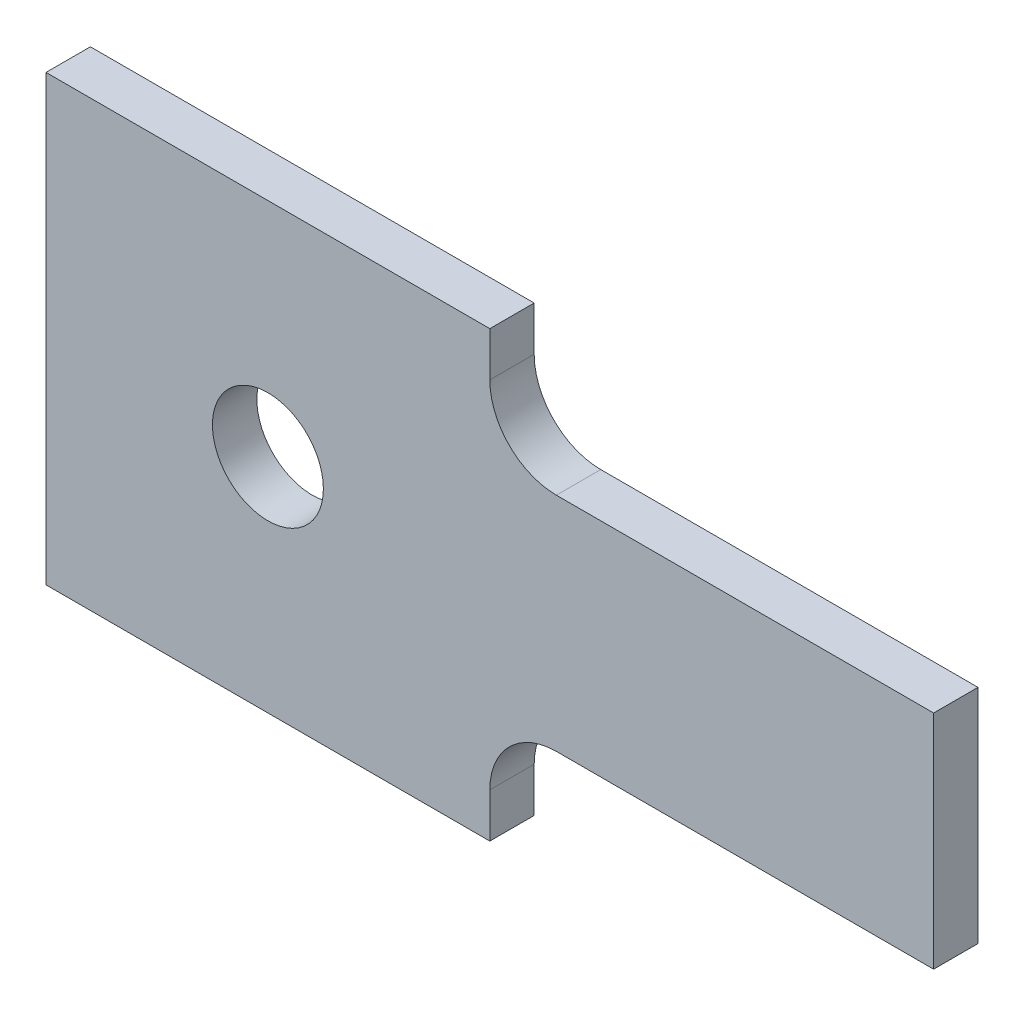
ISO-10303-21;
HEADER;
FILE_DESCRIPTION(('STEP AP214'),'2;1');
FILE_NAME('part.step','',(''),(''),'','','');
FILE_SCHEMA(('AUTOMOTIVE_DESIGN { 1 0 10303 214 1 1 1 1 }'));
ENDSEC;
DATA;
#1=APPLICATION_CONTEXT('core data for automotive mechanical design processes');
#2=APPLICATION_PROTOCOL_DEFINITION('international standard','automotive_design',2000,#1);
#3=PRODUCT_CONTEXT('',#1,'mechanical');
#4=PRODUCT('Part','Part','',(#3));
#5=PRODUCT_RELATED_PRODUCT_CATEGORY('part','',(#4));
#6=PRODUCT_DEFINITION_FORMATION('','',#4);
#7=PRODUCT_DEFINITION_CONTEXT('part definition',#1,'design');
#8=PRODUCT_DEFINITION('design','',#6,#7);
#9=PRODUCT_DEFINITION_SHAPE('','',#8);
#10=(LENGTH_UNIT() NAMED_UNIT(*) SI_UNIT(.MILLI.,.METRE.));
#11=(NAMED_UNIT(*) PLANE_ANGLE_UNIT() SI_UNIT($,.RADIAN.));
#12=(NAMED_UNIT(*) SI_UNIT($,.STERADIAN.) SOLID_ANGLE_UNIT());
#13=UNCERTAINTY_MEASURE_WITH_UNIT(LENGTH_MEASURE(1.E-05),#10,'distance_accuracy_value','');
#14=(GEOMETRIC_REPRESENTATION_CONTEXT(3) GLOBAL_UNCERTAINTY_ASSIGNED_CONTEXT((#13)) GLOBAL_UNIT_ASSIGNED_CONTEXT((#10,
#11,#12)) REPRESENTATION_CONTEXT('',''));
#15=CARTESIAN_POINT('',(0.,0.,0.));
#16=DIRECTION('',(0.,0.,1.));
#17=DIRECTION('',(1.,0.,0.));
#18=AXIS2_PLACEMENT_3D('',#15,#16,#17);
#19=CARTESIAN_POINT('',(0.,50.,10.));
#20=DIRECTION('',(1.,0.,0.));
#21=DIRECTION('',(0.,0.,-1.));
#22=AXIS2_PLACEMENT_3D('',#19,#20,#21);
#23=PLANE('',#22);
#24=DIRECTION('',(0.,-1.,0.));
#25=VECTOR('',#24,1.);
#26=CARTESIAN_POINT('',(0.,50.,5.));
#27=LINE('',#26,#25);
#28=CARTESIAN_POINT('',(0.,0.,5.));
#29=VERTEX_POINT('',#28);
#30=CARTESIAN_POINT('',(0.,-50.,5.));
#31=VERTEX_POINT('',#30);
#32=EDGE_CURVE('E11',#29,#31,#27,.T.);
#33=ORIENTED_EDGE('',*,*,#32,.F.);
#34=DIRECTION('',(0.,0.,1.));
#35=VECTOR('',#34,1.);
#36=CARTESIAN_POINT('',(0.,0.,10.));
#37=LINE('',#36,#35);
#38=CARTESIAN_POINT('',(0.,0.,0.));
#39=VERTEX_POINT('',#38);
#40=EDGE_CURVE('E163',#39,#29,#37,.T.);
#41=ORIENTED_EDGE('',*,*,#40,.F.);
#42=DIRECTION('',(0.,-1.,0.));
#43=VECTOR('',#42,1.);
#44=CARTESIAN_POINT('',(0.,50.,0.));
#45=LINE('',#44,#43);
#46=CARTESIAN_POINT('',(0.,-50.,0.));
#47=VERTEX_POINT('',#46);
#48=EDGE_CURVE('E197',#39,#47,#45,.T.);
#49=ORIENTED_EDGE('',*,*,#48,.T.);
#50=DIRECTION('',(0.,0.,-1.));
#51=VECTOR('',#50,1.);
#52=CARTESIAN_POINT('',(0.,-50.,10.));
#53=LINE('',#52,#51);
#54=EDGE_CURVE('E236',#31,#47,#53,.T.);
#55=ORIENTED_EDGE('',*,*,#54,.F.);
#56=EDGE_LOOP('',(#33,#41,#49,#55));
#57=FACE_BOUND('',#56,.T.);
#58=ADVANCED_FACE('F45',(#57),#23,.F.);
#59=DIRECTION('',(0.,-1.,0.));
#60=VECTOR('',#59,1.);
#61=CARTESIAN_POINT('',(0.,50.,5.));
#62=LINE('',#61,#60);
#63=CARTESIAN_POINT('',(0.,50.,5.));
#64=VERTEX_POINT('',#63);
#65=EDGE_CURVE('E49',#64,#29,#62,.T.);
#66=ORIENTED_EDGE('',*,*,#65,.F.);
#67=DIRECTION('',(0.,0.,-1.));
#68=VECTOR('',#67,1.);
#69=CARTESIAN_POINT('',(0.,50.,10.));
#70=LINE('',#69,#68);
#71=CARTESIAN_POINT('',(0.,50.,0.));
#72=VERTEX_POINT('',#71);
#73=EDGE_CURVE('E160',#64,#72,#70,.T.);
#74=ORIENTED_EDGE('',*,*,#73,.T.);
#75=EDGE_CURVE('E199',#72,#39,#45,.T.);
#76=ORIENTED_EDGE('',*,*,#75,.T.);
#77=ORIENTED_EDGE('',*,*,#40,.T.);
#78=EDGE_LOOP('',(#66,#74,#76,#77));
#79=FACE_BOUND('',#78,.T.);
#80=ADVANCED_FACE('F280',(#79),#23,.F.);
#81=CARTESIAN_POINT('',(0.,0.,10.));
#82=VERTEX_POINT('',#81);
#83=EDGE_CURVE('E143',#29,#82,#37,.T.);
#84=ORIENTED_EDGE('',*,*,#83,.F.);
#85=ORIENTED_EDGE('',*,*,#32,.T.);
#86=CARTESIAN_POINT('',(0.,-50.,10.));
#87=VERTEX_POINT('',#86);
#88=EDGE_CURVE('E165',#87,#31,#53,.T.);
#89=ORIENTED_EDGE('',*,*,#88,.F.);
#90=DIRECTION('',(0.,-1.,0.));
#91=VECTOR('',#90,1.);
#92=CARTESIAN_POINT('',(0.,50.,10.));
#93=LINE('',#92,#91);
#94=EDGE_CURVE('E147',#82,#87,#93,.T.);
#95=ORIENTED_EDGE('',*,*,#94,.F.);
#96=EDGE_LOOP('',(#84,#85,#89,#95));
#97=FACE_BOUND('',#96,.T.);
#98=ADVANCED_FACE('F175',(#97),#23,.F.);
#99=CARTESIAN_POINT('',(100.,50.,10.));
#100=DIRECTION('',(0.,-1.,0.));
#101=DIRECTION('',(1.,0.,0.));
#102=AXIS2_PLACEMENT_3D('',#99,#100,#101);
#103=PLANE('',#102);
#104=DIRECTION('',(-1.,0.,0.));
#105=VECTOR('',#104,1.);
#106=CARTESIAN_POINT('',(100.,50.,0.));
#107=LINE('',#106,#105);
#108=CARTESIAN_POINT('',(100.,50.,0.));
#109=VERTEX_POINT('',#108);
#110=EDGE_CURVE('E195',#109,#72,#107,.T.);
#111=ORIENTED_EDGE('',*,*,#110,.T.);
#112=ORIENTED_EDGE('',*,*,#73,.F.);
#113=CARTESIAN_POINT('',(0.,50.,10.));
#114=VERTEX_POINT('',#113);
#115=EDGE_CURVE('E142',#114,#64,#70,.T.);
#116=ORIENTED_EDGE('',*,*,#115,.F.);
#117=DIRECTION('',(-1.,0.,0.));
#118=VECTOR('',#117,1.);
#119=CARTESIAN_POINT('',(100.,50.,10.));
#120=LINE('',#119,#118);
#121=CARTESIAN_POINT('',(100.,50.,10.));
#122=VERTEX_POINT('',#121);
#123=EDGE_CURVE('E150',#122,#114,#120,.T.);
#124=ORIENTED_EDGE('',*,*,#123,.F.);
#125=DIRECTION('',(0.,0.,-1.));
#126=VECTOR('',#125,1.);
#127=CARTESIAN_POINT('',(100.,50.,10.));
#128=LINE('',#127,#126);
#129=EDGE_CURVE('E194',#122,#109,#128,.T.);
#130=ORIENTED_EDGE('',*,*,#129,.T.);
#131=EDGE_LOOP('',(#111,#112,#116,#124,#130));
#132=FACE_BOUND('',#131,.T.);
#133=ADVANCED_FACE('F47',(#132),#103,.F.);
#134=ORIENTED_EDGE('',*,*,#115,.T.);
#135=ORIENTED_EDGE('',*,*,#65,.T.);
#136=ORIENTED_EDGE('',*,*,#83,.T.);
#137=EDGE_CURVE('E138',#114,#82,#93,.T.);
#138=ORIENTED_EDGE('',*,*,#137,.F.);
#139=EDGE_LOOP('',(#134,#135,#136,#138));
#140=FACE_BOUND('',#139,.T.);
#141=ADVANCED_FACE('F140',(#140),#23,.F.);
#142=CARTESIAN_POINT('',(100.,-50.,10.));
#143=DIRECTION('',(0.,1.,0.));
#144=DIRECTION('',(-1.,0.,0.));
#145=AXIS2_PLACEMENT_3D('',#142,#143,#144);
#146=PLANE('',#145);
#147=DIRECTION('',(1.,0.,0.));
#148=VECTOR('',#147,1.);
#149=CARTESIAN_POINT('',(100.,-50.,0.));
#150=LINE('',#149,#148);
#151=CARTESIAN_POINT('',(100.,-50.,0.));
#152=VERTEX_POINT('',#151);
#153=EDGE_CURVE('E201',#47,#152,#150,.T.);
#154=ORIENTED_EDGE('',*,*,#153,.T.);
#155=DIRECTION('',(0.,0.,-1.));
#156=VECTOR('',#155,1.);
#157=CARTESIAN_POINT('',(100.,-50.,10.));
#158=LINE('',#157,#156);
#159=CARTESIAN_POINT('',(100.,-50.,10.));
#160=VERTEX_POINT('',#159);
#161=EDGE_CURVE('E234',#160,#152,#158,.T.);
#162=ORIENTED_EDGE('',*,*,#161,.F.);
#163=DIRECTION('',(1.,0.,0.));
#164=VECTOR('',#163,1.);
#165=CARTESIAN_POINT('',(100.,-50.,10.));
#166=LINE('',#165,#164);
#167=EDGE_CURVE('E146',#87,#160,#166,.T.);
#168=ORIENTED_EDGE('',*,*,#167,.F.);
#169=ORIENTED_EDGE('',*,*,#88,.T.);
#170=ORIENTED_EDGE('',*,*,#54,.T.);
#171=EDGE_LOOP('',(#154,#162,#168,#169,#170));
#172=FACE_BOUND('',#171,.T.);
#173=ADVANCED_FACE('F243',(#172),#146,.F.);
#174=CARTESIAN_POINT('',(100.,-40.0000000000001,10.));
#175=DIRECTION('',(-1.,0.,0.));
#176=DIRECTION('',(0.,0.,1.));
#177=AXIS2_PLACEMENT_3D('',#174,#175,#176);
#178=PLANE('',#177);
#179=DIRECTION('',(0.,1.,0.));
#180=VECTOR('',#179,1.);
#181=CARTESIAN_POINT('',(100.,-40.0000000000001,0.));
#182=LINE('',#181,#180);
#183=CARTESIAN_POINT('',(100.,-40.0000000000001,0.));
#184=VERTEX_POINT('',#183);
#185=EDGE_CURVE('E203',#152,#184,#182,.T.);
#186=ORIENTED_EDGE('',*,*,#185,.T.);
#187=DIRECTION('',(0.,0.,-1.));
#188=VECTOR('',#187,1.);
#189=CARTESIAN_POINT('',(100.,-40.0000000000001,10.));
#190=LINE('',#189,#188);
#191=CARTESIAN_POINT('',(100.,-40.0000000000001,10.));
#192=VERTEX_POINT('',#191);
#193=EDGE_CURVE('E232',#192,#184,#190,.T.);
#194=ORIENTED_EDGE('',*,*,#193,.F.);
#195=DIRECTION('',(0.,1.,0.));
#196=VECTOR('',#195,1.);
#197=CARTESIAN_POINT('',(100.,-40.0000000000001,10.));
#198=LINE('',#197,#196);
#199=EDGE_CURVE('E181',#160,#192,#198,.T.);
#200=ORIENTED_EDGE('',*,*,#199,.F.);
#201=ORIENTED_EDGE('',*,*,#161,.T.);
#202=EDGE_LOOP('',(#186,#194,#200,#201));
#203=FACE_BOUND('',#202,.T.);
#204=ADVANCED_FACE('F247',(#203),#178,.F.);
#205=CARTESIAN_POINT('',(115.,-40.,10.));
#206=DIRECTION('',(0.,0.,-1.));
#207=DIRECTION('',(-1.,0.,0.));
#208=AXIS2_PLACEMENT_3D('',#205,#206,#207);
#209=CYLINDRICAL_SURFACE('',#208,15.);
#210=CARTESIAN_POINT('',(115.,-40.,0.));
#211=DIRECTION('',(0.,0.,-1.));
#212=DIRECTION('',(1.,0.,0.));
#213=AXIS2_PLACEMENT_3D('',#210,#211,#212);
#214=CIRCLE('',#213,15.);
#215=CARTESIAN_POINT('',(115.,-25.,0.));
#216=VERTEX_POINT('',#215);
#217=EDGE_CURVE('E205',#184,#216,#214,.T.);
#218=ORIENTED_EDGE('',*,*,#217,.T.);
#219=DIRECTION('',(0.,0.,-1.));
#220=VECTOR('',#219,1.);
#221=CARTESIAN_POINT('',(115.,-25.,10.));
#222=LINE('',#221,#220);
#223=CARTESIAN_POINT('',(115.,-25.,10.));
#224=VERTEX_POINT('',#223);
#225=EDGE_CURVE('E229',#224,#216,#222,.T.);
#226=ORIENTED_EDGE('',*,*,#225,.F.);
#227=CARTESIAN_POINT('',(115.,-40.,10.));
#228=DIRECTION('',(0.,0.,-1.));
#229=DIRECTION('',(1.,0.,0.));
#230=AXIS2_PLACEMENT_3D('',#227,#228,#229);
#231=CIRCLE('',#230,15.);
#232=EDGE_CURVE('E183',#192,#224,#231,.T.);
#233=ORIENTED_EDGE('',*,*,#232,.F.);
#234=ORIENTED_EDGE('',*,*,#193,.T.);
#235=EDGE_LOOP('',(#218,#226,#233,#234));
#236=FACE_BOUND('',#235,.T.);
#237=ADVANCED_FACE('F250',(#236),#209,.F.);
#238=CARTESIAN_POINT('',(200.,-25.,10.));
#239=DIRECTION('',(0.,1.,0.));
#240=DIRECTION('',(-1.,0.,0.));
#241=AXIS2_PLACEMENT_3D('',#238,#239,#240);
#242=PLANE('',#241);
#243=DIRECTION('',(1.,0.,0.));
#244=VECTOR('',#243,1.);
#245=CARTESIAN_POINT('',(200.,-25.,0.));
#246=LINE('',#245,#244);
#247=CARTESIAN_POINT('',(200.,-25.,0.));
#248=VERTEX_POINT('',#247);
#249=EDGE_CURVE('E207',#216,#248,#246,.T.);
#250=ORIENTED_EDGE('',*,*,#249,.T.);
#251=DIRECTION('',(0.,0.,-1.));
#252=VECTOR('',#251,1.);
#253=CARTESIAN_POINT('',(200.,-25.,10.));
#254=LINE('',#253,#252);
#255=CARTESIAN_POINT('',(200.,-25.,10.));
#256=VERTEX_POINT('',#255);
#257=EDGE_CURVE('E226',#256,#248,#254,.T.);
#258=ORIENTED_EDGE('',*,*,#257,.F.);
#259=DIRECTION('',(1.,0.,0.));
#260=VECTOR('',#259,1.);
#261=CARTESIAN_POINT('',(200.,-25.,10.));
#262=LINE('',#261,#260);
#263=EDGE_CURVE('E185',#224,#256,#262,.T.);
#264=ORIENTED_EDGE('',*,*,#263,.F.);
#265=ORIENTED_EDGE('',*,*,#225,.T.);
#266=EDGE_LOOP('',(#250,#258,#264,#265));
#267=FACE_BOUND('',#266,.T.);
#268=ADVANCED_FACE('F255',(#267),#242,.F.);
#269=CARTESIAN_POINT('',(200.,-25.,10.));
#270=DIRECTION('',(-1.,0.,0.));
#271=DIRECTION('',(0.,0.,1.));
#272=AXIS2_PLACEMENT_3D('',#269,#270,#271);
#273=PLANE('',#272);
#274=DIRECTION('',(0.,1.,0.));
#275=VECTOR('',#274,1.);
#276=CARTESIAN_POINT('',(200.,-25.,0.));
#277=LINE('',#276,#275);
#278=CARTESIAN_POINT('',(200.,25.,0.));
#279=VERTEX_POINT('',#278);
#280=EDGE_CURVE('E209',#248,#279,#277,.T.);
#281=ORIENTED_EDGE('',*,*,#280,.T.);
#282=DIRECTION('',(0.,0.,-1.));
#283=VECTOR('',#282,1.);
#284=CARTESIAN_POINT('',(200.,25.,10.));
#285=LINE('',#284,#283);
#286=CARTESIAN_POINT('',(200.,25.,10.));
#287=VERTEX_POINT('',#286);
#288=EDGE_CURVE('E223',#287,#279,#285,.T.);
#289=ORIENTED_EDGE('',*,*,#288,.F.);
#290=DIRECTION('',(0.,1.,0.));
#291=VECTOR('',#290,1.);
#292=CARTESIAN_POINT('',(200.,-25.,10.));
#293=LINE('',#292,#291);
#294=EDGE_CURVE('E187',#256,#287,#293,.T.);
#295=ORIENTED_EDGE('',*,*,#294,.F.);
#296=ORIENTED_EDGE('',*,*,#257,.T.);
#297=EDGE_LOOP('',(#281,#289,#295,#296));
#298=FACE_BOUND('',#297,.T.);
#299=ADVANCED_FACE('F261',(#298),#273,.F.);
#300=CARTESIAN_POINT('',(200.,25.,10.));
#301=DIRECTION('',(0.,-1.,0.));
#302=DIRECTION('',(1.,0.,0.));
#303=AXIS2_PLACEMENT_3D('',#300,#301,#302);
#304=PLANE('',#303);
#305=DIRECTION('',(-1.,0.,0.));
#306=VECTOR('',#305,1.);
#307=CARTESIAN_POINT('',(200.,25.,0.));
#308=LINE('',#307,#306);
#309=CARTESIAN_POINT('',(115.,25.,0.));
#310=VERTEX_POINT('',#309);
#311=EDGE_CURVE('E211',#279,#310,#308,.T.);
#312=ORIENTED_EDGE('',*,*,#311,.T.);
#313=DIRECTION('',(0.,0.,-1.));
#314=VECTOR('',#313,1.);
#315=CARTESIAN_POINT('',(115.,25.,10.));
#316=LINE('',#315,#314);
#317=CARTESIAN_POINT('',(115.,25.,10.));
#318=VERTEX_POINT('',#317);
#319=EDGE_CURVE('E220',#318,#310,#316,.T.);
#320=ORIENTED_EDGE('',*,*,#319,.F.);
#321=DIRECTION('',(-1.,0.,0.));
#322=VECTOR('',#321,1.);
#323=CARTESIAN_POINT('',(200.,25.,10.));
#324=LINE('',#323,#322);
#325=EDGE_CURVE('E189',#287,#318,#324,.T.);
#326=ORIENTED_EDGE('',*,*,#325,.F.);
#327=ORIENTED_EDGE('',*,*,#288,.T.);
#328=EDGE_LOOP('',(#312,#320,#326,#327));
#329=FACE_BOUND('',#328,.T.);
#330=ADVANCED_FACE('F265',(#329),#304,.F.);
#331=CARTESIAN_POINT('',(115.,40.,10.));
#332=DIRECTION('',(0.,0.,-1.));
#333=DIRECTION('',(-1.,0.,0.));
#334=AXIS2_PLACEMENT_3D('',#331,#332,#333);
#335=CYLINDRICAL_SURFACE('',#334,15.);
#336=CARTESIAN_POINT('',(115.,40.,0.));
#337=DIRECTION('',(0.,0.,-1.));
#338=DIRECTION('',(-1.,0.,0.));
#339=AXIS2_PLACEMENT_3D('',#336,#337,#338);
#340=CIRCLE('',#339,15.);
#341=CARTESIAN_POINT('',(100.,40.0000000000001,0.));
#342=VERTEX_POINT('',#341);
#343=EDGE_CURVE('E213',#310,#342,#340,.T.);
#344=ORIENTED_EDGE('',*,*,#343,.T.);
#345=DIRECTION('',(0.,0.,-1.));
#346=VECTOR('',#345,1.);
#347=CARTESIAN_POINT('',(100.,40.0000000000001,10.));
#348=LINE('',#347,#346);
#349=CARTESIAN_POINT('',(100.,40.0000000000001,10.));
#350=VERTEX_POINT('',#349);
#351=EDGE_CURVE('E217',#350,#342,#348,.T.);
#352=ORIENTED_EDGE('',*,*,#351,.F.);
#353=CARTESIAN_POINT('',(115.,40.,10.));
#354=DIRECTION('',(0.,0.,-1.));
#355=DIRECTION('',(-1.,0.,0.));
#356=AXIS2_PLACEMENT_3D('',#353,#354,#355);
#357=CIRCLE('',#356,15.);
#358=EDGE_CURVE('E191',#318,#350,#357,.T.);
#359=ORIENTED_EDGE('',*,*,#358,.F.);
#360=ORIENTED_EDGE('',*,*,#319,.T.);
#361=EDGE_LOOP('',(#344,#352,#359,#360));
#362=FACE_BOUND('',#361,.T.);
#363=ADVANCED_FACE('F270',(#362),#335,.F.);
#364=CARTESIAN_POINT('',(100.,40.0000000000001,10.));
#365=DIRECTION('',(-1.,0.,0.));
#366=DIRECTION('',(0.,0.,1.));
#367=AXIS2_PLACEMENT_3D('',#364,#365,#366);
#368=PLANE('',#367);
#369=DIRECTION('',(0.,1.,0.));
#370=VECTOR('',#369,1.);
#371=CARTESIAN_POINT('',(100.,40.0000000000001,0.));
#372=LINE('',#371,#370);
#373=EDGE_CURVE('E157',#342,#109,#372,.T.);
#374=ORIENTED_EDGE('',*,*,#373,.T.);
#375=ORIENTED_EDGE('',*,*,#129,.F.);
#376=DIRECTION('',(0.,1.,0.));
#377=VECTOR('',#376,1.);
#378=CARTESIAN_POINT('',(100.,40.0000000000001,10.));
#379=LINE('',#378,#377);
#380=EDGE_CURVE('E153',#350,#122,#379,.T.);
#381=ORIENTED_EDGE('',*,*,#380,.F.);
#382=ORIENTED_EDGE('',*,*,#351,.T.);
#383=EDGE_LOOP('',(#374,#375,#381,#382));
#384=FACE_BOUND('',#383,.T.);
#385=ADVANCED_FACE('F273',(#384),#368,.F.);
#386=CARTESIAN_POINT('',(115.,-40.,10.));
#387=DIRECTION('',(0.,0.,1.));
#388=DIRECTION('',(1.,0.,0.));
#389=AXIS2_PLACEMENT_3D('',#386,#387,#388);
#390=PLANE('',#389);
#391=CARTESIAN_POINT('',(50.,0.,10.));
#392=DIRECTION('',(0.,0.,1.));
#393=DIRECTION('',(1.,0.,0.));
#394=AXIS2_PLACEMENT_3D('',#391,#392,#393);
#395=CIRCLE('',#394,12.5);
#396=CARTESIAN_POINT('',(62.5,0.,10.));
#397=VERTEX_POINT('',#396);
#398=EDGE_CURVE('E321',#397,#397,#395,.T.);
#399=ORIENTED_EDGE('',*,*,#398,.F.);
#400=EDGE_LOOP('',(#399));
#401=FACE_BOUND('',#400,.T.);
#402=ORIENTED_EDGE('',*,*,#123,.T.);
#403=ORIENTED_EDGE('',*,*,#137,.T.);
#404=ORIENTED_EDGE('',*,*,#94,.T.);
#405=ORIENTED_EDGE('',*,*,#167,.T.);
#406=ORIENTED_EDGE('',*,*,#199,.T.);
#407=ORIENTED_EDGE('',*,*,#232,.T.);
#408=ORIENTED_EDGE('',*,*,#263,.T.);
#409=ORIENTED_EDGE('',*,*,#294,.T.);
#410=ORIENTED_EDGE('',*,*,#325,.T.);
#411=ORIENTED_EDGE('',*,*,#358,.T.);
#412=ORIENTED_EDGE('',*,*,#380,.T.);
#413=EDGE_LOOP('',(#402,#403,#404,#405,#406,#407,#408,#409,#410,#411,#412));
#414=FACE_BOUND('',#413,.T.);
#415=ADVANCED_FACE('F151',(#401,#414),#390,.T.);
#416=CARTESIAN_POINT('',(115.,-40.,0.));
#417=DIRECTION('',(0.,0.,1.));
#418=DIRECTION('',(1.,0.,0.));
#419=AXIS2_PLACEMENT_3D('',#416,#417,#418);
#420=PLANE('',#419);
#421=CARTESIAN_POINT('',(50.,0.,0.));
#422=DIRECTION('',(0.,0.,1.));
#423=DIRECTION('',(1.,0.,0.));
#424=AXIS2_PLACEMENT_3D('',#421,#422,#423);
#425=CIRCLE('',#424,12.5);
#426=CARTESIAN_POINT('',(62.5,0.,0.));
#427=VERTEX_POINT('',#426);
#428=EDGE_CURVE('E198',#427,#427,#425,.T.);
#429=ORIENTED_EDGE('',*,*,#428,.T.);
#430=EDGE_LOOP('',(#429));
#431=FACE_BOUND('',#430,.T.);
#432=ORIENTED_EDGE('',*,*,#110,.F.);
#433=ORIENTED_EDGE('',*,*,#373,.F.);
#434=ORIENTED_EDGE('',*,*,#343,.F.);
#435=ORIENTED_EDGE('',*,*,#311,.F.);
#436=ORIENTED_EDGE('',*,*,#280,.F.);
#437=ORIENTED_EDGE('',*,*,#249,.F.);
#438=ORIENTED_EDGE('',*,*,#217,.F.);
#439=ORIENTED_EDGE('',*,*,#185,.F.);
#440=ORIENTED_EDGE('',*,*,#153,.F.);
#441=ORIENTED_EDGE('',*,*,#48,.F.);
#442=ORIENTED_EDGE('',*,*,#75,.F.);
#443=EDGE_LOOP('',(#432,#433,#434,#435,#436,#437,#438,#439,#440,#441,#442));
#444=FACE_BOUND('',#443,.T.);
#445=ADVANCED_FACE('F277',(#431,#444),#420,.F.);
#446=CARTESIAN_POINT('',(50.,0.,0.));
#447=DIRECTION('',(0.,0.,1.));
#448=DIRECTION('',(1.,0.,0.));
#449=AXIS2_PLACEMENT_3D('',#446,#447,#448);
#450=CYLINDRICAL_SURFACE('',#449,12.5);
#451=ORIENTED_EDGE('',*,*,#428,.F.);
#452=EDGE_LOOP('',(#451));
#453=FACE_BOUND('',#452,.T.);
#454=ORIENTED_EDGE('',*,*,#398,.T.);
#455=EDGE_LOOP('',(#454));
#456=FACE_BOUND('',#455,.T.);
#457=ADVANCED_FACE('F307',(#453,#456),#450,.F.);
#458=CLOSED_SHELL('',(#58,#80,#98,#133,#141,#173,#204,#237,#268,#299,#330,#363,#385,#415,#445,#457));
#459=MANIFOLD_SOLID_BREP('B2',#458);
#460=ADVANCED_BREP_SHAPE_REPRESENTATION('',(#18,#459),#14);
#461=SHAPE_DEFINITION_REPRESENTATION(#9,#460);
ENDSEC;
END-ISO-10303-21;
